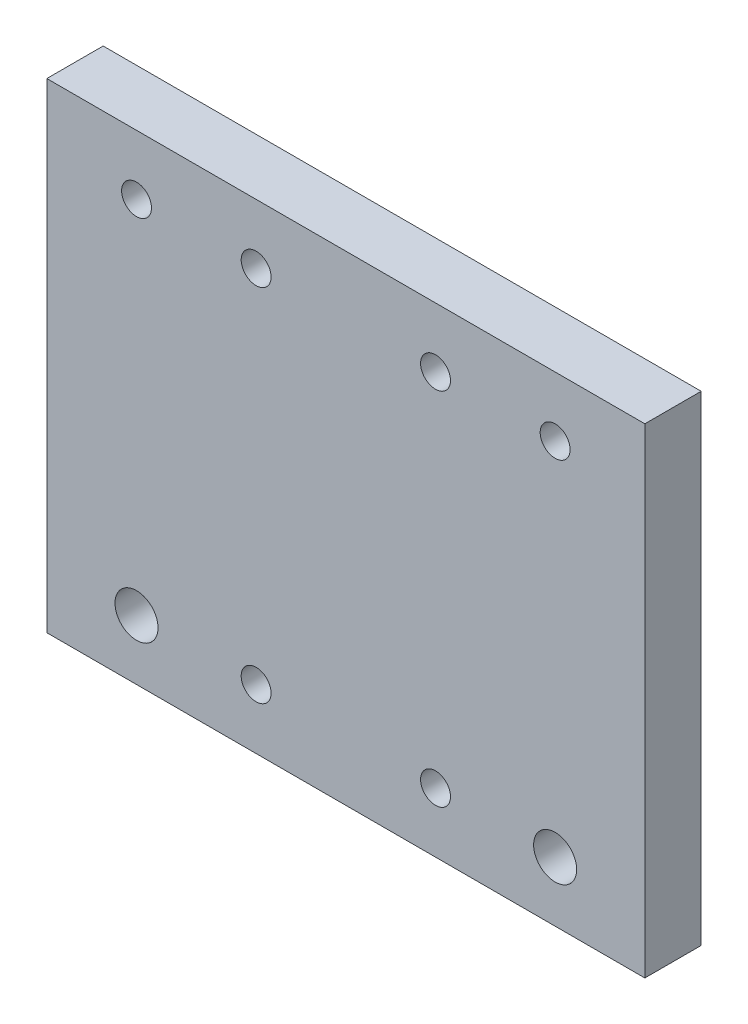
ISO-10303-21;
HEADER;
FILE_DESCRIPTION(('STEP AP214'),'2;1');
FILE_NAME('part.step','',(''),(''),'','','');
FILE_SCHEMA(('AUTOMOTIVE_DESIGN { 1 0 10303 214 1 1 1 1 }'));
ENDSEC;
DATA;
#1=APPLICATION_CONTEXT('core data for automotive mechanical design processes');
#2=APPLICATION_PROTOCOL_DEFINITION('international standard','automotive_design',2000,#1);
#3=PRODUCT_CONTEXT('',#1,'mechanical');
#4=PRODUCT('Part','Part','',(#3));
#5=PRODUCT_RELATED_PRODUCT_CATEGORY('part','',(#4));
#6=PRODUCT_DEFINITION_FORMATION('','',#4);
#7=PRODUCT_DEFINITION_CONTEXT('part definition',#1,'design');
#8=PRODUCT_DEFINITION('design','',#6,#7);
#9=PRODUCT_DEFINITION_SHAPE('','',#8);
#10=(LENGTH_UNIT() NAMED_UNIT(*) SI_UNIT(.MILLI.,.METRE.));
#11=(NAMED_UNIT(*) PLANE_ANGLE_UNIT() SI_UNIT($,.RADIAN.));
#12=(NAMED_UNIT(*) SI_UNIT($,.STERADIAN.) SOLID_ANGLE_UNIT());
#13=UNCERTAINTY_MEASURE_WITH_UNIT(LENGTH_MEASURE(1.E-05),#10,'distance_accuracy_value','');
#14=(GEOMETRIC_REPRESENTATION_CONTEXT(3) GLOBAL_UNCERTAINTY_ASSIGNED_CONTEXT((#13)) GLOBAL_UNIT_ASSIGNED_CONTEXT((#10,
#11,#12)) REPRESENTATION_CONTEXT('',''));
#15=CARTESIAN_POINT('',(0.,0.,0.));
#16=DIRECTION('',(0.,0.,1.));
#17=DIRECTION('',(1.,0.,0.));
#18=AXIS2_PLACEMENT_3D('',#15,#16,#17);
#19=CARTESIAN_POINT('',(0.,0.,9.42));
#20=DIRECTION('',(0.,0.,-1.));
#21=DIRECTION('',(-1.,0.,0.));
#22=AXIS2_PLACEMENT_3D('',#19,#20,#21);
#23=PLANE('',#22);
#24=CARTESIAN_POINT('',(37.710746881296,44.9525516862519,9.42));
#25=DIRECTION('',(0.,0.,1.));
#26=DIRECTION('',(1.,0.,0.));
#27=AXIS2_PLACEMENT_3D('',#24,#25,#26);
#28=CIRCLE('',#27,2.5);
#29=CARTESIAN_POINT('',(40.210746881296,44.9525516862519,9.42));
#30=VERTEX_POINT('',#29);
#31=EDGE_CURVE('E155',#30,#30,#28,.T.);
#32=ORIENTED_EDGE('',*,*,#31,.F.);
#33=EDGE_LOOP('',(#32));
#34=FACE_BOUND('',#33,.T.);
#35=CARTESIAN_POINT('',(67.710746881296,44.9525516862519,9.42));
#36=DIRECTION('',(0.,0.,1.));
#37=DIRECTION('',(1.,0.,0.));
#38=AXIS2_PLACEMENT_3D('',#35,#36,#37);
#39=CIRCLE('',#38,2.5);
#40=CARTESIAN_POINT('',(70.210746881296,44.9525516862519,9.42));
#41=VERTEX_POINT('',#40);
#42=EDGE_CURVE('E161',#41,#41,#39,.T.);
#43=ORIENTED_EDGE('',*,*,#42,.F.);
#44=EDGE_LOOP('',(#43));
#45=FACE_BOUND('',#44,.T.);
#46=CARTESIAN_POINT('',(67.710746881296,-15.3074483137481,9.42));
#47=DIRECTION('',(0.,0.,1.));
#48=DIRECTION('',(1.,0.,0.));
#49=AXIS2_PLACEMENT_3D('',#46,#47,#48);
#50=CIRCLE('',#49,2.49999999999999);
#51=CARTESIAN_POINT('',(70.210746881296,-15.3074483137481,9.42));
#52=VERTEX_POINT('',#51);
#53=EDGE_CURVE('E167',#52,#52,#50,.T.);
#54=ORIENTED_EDGE('',*,*,#53,.F.);
#55=EDGE_LOOP('',(#54));
#56=FACE_BOUND('',#55,.T.);
#57=CARTESIAN_POINT('',(37.710746881296,-15.3074483137481,9.42));
#58=DIRECTION('',(0.,0.,1.));
#59=DIRECTION('',(1.,0.,0.));
#60=AXIS2_PLACEMENT_3D('',#57,#58,#59);
#61=CIRCLE('',#60,2.5);
#62=CARTESIAN_POINT('',(40.210746881296,-15.3074483137481,9.42));
#63=VERTEX_POINT('',#62);
#64=EDGE_CURVE('E149',#63,#63,#61,.T.);
#65=ORIENTED_EDGE('',*,*,#64,.F.);
#66=EDGE_LOOP('',(#65));
#67=FACE_BOUND('',#66,.T.);
#68=DIRECTION('',(0.,-1.,0.));
#69=VECTOR('',#68,1.);
#70=CARTESIAN_POINT('',(2.71074688129598,-25.3074483137481,9.42));
#71=LINE('',#70,#69);
#72=CARTESIAN_POINT('',(2.71074688129598,54.9525516862519,9.42));
#73=VERTEX_POINT('',#72);
#74=CARTESIAN_POINT('',(2.71074688129598,-25.3074483137481,9.42));
#75=VERTEX_POINT('',#74);
#76=EDGE_CURVE('E98',#73,#75,#71,.T.);
#77=ORIENTED_EDGE('',*,*,#76,.T.);
#78=DIRECTION('',(1.,0.,0.));
#79=VECTOR('',#78,1.);
#80=CARTESIAN_POINT('',(2.71074688129598,-25.3074483137481,9.42));
#81=LINE('',#80,#79);
#82=CARTESIAN_POINT('',(102.710746881296,-25.3074483137481,9.42));
#83=VERTEX_POINT('',#82);
#84=EDGE_CURVE('E93',#75,#83,#81,.T.);
#85=ORIENTED_EDGE('',*,*,#84,.T.);
#86=DIRECTION('',(0.,1.,0.));
#87=VECTOR('',#86,1.);
#88=CARTESIAN_POINT('',(102.710746881296,-25.3074483137481,9.42));
#89=LINE('',#88,#87);
#90=CARTESIAN_POINT('',(102.710746881296,54.9525516862519,9.42));
#91=VERTEX_POINT('',#90);
#92=EDGE_CURVE('E96',#83,#91,#89,.T.);
#93=ORIENTED_EDGE('',*,*,#92,.T.);
#94=DIRECTION('',(-1.,0.,0.));
#95=VECTOR('',#94,1.);
#96=CARTESIAN_POINT('',(2.71074688129598,54.9525516862519,9.42));
#97=LINE('',#96,#95);
#98=EDGE_CURVE('E63',#91,#73,#97,.T.);
#99=ORIENTED_EDGE('',*,*,#98,.T.);
#100=EDGE_LOOP('',(#77,#85,#93,#99));
#101=FACE_BOUND('',#100,.T.);
#102=CARTESIAN_POINT('',(17.710746881296,-15.3074483137481,9.42));
#103=DIRECTION('',(0.,0.,1.));
#104=DIRECTION('',(1.,0.,0.));
#105=AXIS2_PLACEMENT_3D('',#102,#103,#104);
#106=CIRCLE('',#105,3.6);
#107=CARTESIAN_POINT('',(21.310746881296,-15.3074483137481,9.42));
#108=VERTEX_POINT('',#107);
#109=EDGE_CURVE('E113',#108,#108,#106,.T.);
#110=ORIENTED_EDGE('',*,*,#109,.F.);
#111=EDGE_LOOP('',(#110));
#112=FACE_BOUND('',#111,.T.);
#113=CARTESIAN_POINT('',(87.710746881296,44.9525516862519,9.42));
#114=DIRECTION('',(0.,0.,1.));
#115=DIRECTION('',(1.,0.,0.));
#116=AXIS2_PLACEMENT_3D('',#113,#114,#115);
#117=CIRCLE('',#116,2.5);
#118=CARTESIAN_POINT('',(90.210746881296,44.9525516862519,9.42));
#119=VERTEX_POINT('',#118);
#120=EDGE_CURVE('E128',#119,#119,#117,.T.);
#121=ORIENTED_EDGE('',*,*,#120,.F.);
#122=EDGE_LOOP('',(#121));
#123=FACE_BOUND('',#122,.T.);
#124=CARTESIAN_POINT('',(17.710746881296,44.9525516862519,9.42));
#125=DIRECTION('',(0.,0.,1.));
#126=DIRECTION('',(1.,0.,0.));
#127=AXIS2_PLACEMENT_3D('',#124,#125,#126);
#128=CIRCLE('',#127,2.5);
#129=CARTESIAN_POINT('',(20.210746881296,44.9525516862519,9.42));
#130=VERTEX_POINT('',#129);
#131=EDGE_CURVE('E134',#130,#130,#128,.T.);
#132=ORIENTED_EDGE('',*,*,#131,.F.);
#133=EDGE_LOOP('',(#132));
#134=FACE_BOUND('',#133,.T.);
#135=CARTESIAN_POINT('',(87.710746881296,-15.3074483137481,9.42));
#136=DIRECTION('',(0.,0.,1.));
#137=DIRECTION('',(1.,0.,0.));
#138=AXIS2_PLACEMENT_3D('',#135,#136,#137);
#139=CIRCLE('',#138,3.6);
#140=CARTESIAN_POINT('',(91.310746881296,-15.3074483137481,9.42));
#141=VERTEX_POINT('',#140);
#142=EDGE_CURVE('E140',#141,#141,#139,.T.);
#143=ORIENTED_EDGE('',*,*,#142,.F.);
#144=EDGE_LOOP('',(#143));
#145=FACE_BOUND('',#144,.T.);
#146=ADVANCED_FACE('F46',(#34,#45,#56,#67,#101,#112,#123,#134,#145),#23,.F.);
#147=CARTESIAN_POINT('',(0.,0.,0.));
#148=DIRECTION('',(0.,0.,-1.));
#149=DIRECTION('',(-1.,0.,0.));
#150=AXIS2_PLACEMENT_3D('',#147,#148,#149);
#151=PLANE('',#150);
#152=CARTESIAN_POINT('',(37.710746881296,44.9525516862519,0.));
#153=DIRECTION('',(0.,0.,1.));
#154=DIRECTION('',(1.,0.,0.));
#155=AXIS2_PLACEMENT_3D('',#152,#153,#154);
#156=CIRCLE('',#155,2.5);
#157=CARTESIAN_POINT('',(40.210746881296,44.9525516862519,0.));
#158=VERTEX_POINT('',#157);
#159=EDGE_CURVE('E158',#158,#158,#156,.T.);
#160=ORIENTED_EDGE('',*,*,#159,.T.);
#161=EDGE_LOOP('',(#160));
#162=FACE_BOUND('',#161,.T.);
#163=CARTESIAN_POINT('',(67.710746881296,44.9525516862519,0.));
#164=DIRECTION('',(0.,0.,1.));
#165=DIRECTION('',(1.,0.,0.));
#166=AXIS2_PLACEMENT_3D('',#163,#164,#165);
#167=CIRCLE('',#166,2.5);
#168=CARTESIAN_POINT('',(70.210746881296,44.9525516862519,0.));
#169=VERTEX_POINT('',#168);
#170=EDGE_CURVE('E164',#169,#169,#167,.T.);
#171=ORIENTED_EDGE('',*,*,#170,.T.);
#172=EDGE_LOOP('',(#171));
#173=FACE_BOUND('',#172,.T.);
#174=CARTESIAN_POINT('',(67.710746881296,-15.3074483137481,0.));
#175=DIRECTION('',(0.,0.,1.));
#176=DIRECTION('',(1.,0.,0.));
#177=AXIS2_PLACEMENT_3D('',#174,#175,#176);
#178=CIRCLE('',#177,2.49999999999999);
#179=CARTESIAN_POINT('',(70.210746881296,-15.3074483137481,0.));
#180=VERTEX_POINT('',#179);
#181=EDGE_CURVE('E152',#180,#180,#178,.T.);
#182=ORIENTED_EDGE('',*,*,#181,.T.);
#183=EDGE_LOOP('',(#182));
#184=FACE_BOUND('',#183,.T.);
#185=CARTESIAN_POINT('',(37.710746881296,-15.3074483137481,0.));
#186=DIRECTION('',(0.,0.,1.));
#187=DIRECTION('',(1.,0.,0.));
#188=AXIS2_PLACEMENT_3D('',#185,#186,#187);
#189=CIRCLE('',#188,2.5);
#190=CARTESIAN_POINT('',(40.210746881296,-15.3074483137481,0.));
#191=VERTEX_POINT('',#190);
#192=EDGE_CURVE('E146',#191,#191,#189,.T.);
#193=ORIENTED_EDGE('',*,*,#192,.T.);
#194=EDGE_LOOP('',(#193));
#195=FACE_BOUND('',#194,.T.);
#196=CARTESIAN_POINT('',(17.710746881296,44.9525516862519,0.));
#197=DIRECTION('',(0.,0.,1.));
#198=DIRECTION('',(1.,0.,0.));
#199=AXIS2_PLACEMENT_3D('',#196,#197,#198);
#200=CIRCLE('',#199,2.5);
#201=CARTESIAN_POINT('',(20.210746881296,44.9525516862519,0.));
#202=VERTEX_POINT('',#201);
#203=EDGE_CURVE('E137',#202,#202,#200,.T.);
#204=ORIENTED_EDGE('',*,*,#203,.T.);
#205=EDGE_LOOP('',(#204));
#206=FACE_BOUND('',#205,.T.);
#207=CARTESIAN_POINT('',(17.710746881296,-15.3074483137481,0.));
#208=DIRECTION('',(0.,0.,1.));
#209=DIRECTION('',(1.,0.,0.));
#210=AXIS2_PLACEMENT_3D('',#207,#208,#209);
#211=CIRCLE('',#210,3.6);
#212=CARTESIAN_POINT('',(21.310746881296,-15.3074483137481,0.));
#213=VERTEX_POINT('',#212);
#214=EDGE_CURVE('E125',#213,#213,#211,.T.);
#215=ORIENTED_EDGE('',*,*,#214,.T.);
#216=EDGE_LOOP('',(#215));
#217=FACE_BOUND('',#216,.T.);
#218=DIRECTION('',(0.,-1.,0.));
#219=VECTOR('',#218,1.);
#220=CARTESIAN_POINT('',(2.71074688129598,-25.3074483137481,0.));
#221=LINE('',#220,#219);
#222=CARTESIAN_POINT('',(2.71074688129598,54.9525516862519,0.));
#223=VERTEX_POINT('',#222);
#224=CARTESIAN_POINT('',(2.71074688129598,-25.3074483137481,0.));
#225=VERTEX_POINT('',#224);
#226=EDGE_CURVE('E110',#223,#225,#221,.T.);
#227=ORIENTED_EDGE('',*,*,#226,.F.);
#228=DIRECTION('',(-1.,0.,0.));
#229=VECTOR('',#228,1.);
#230=CARTESIAN_POINT('',(2.71074688129598,54.9525516862519,0.));
#231=LINE('',#230,#229);
#232=CARTESIAN_POINT('',(102.710746881296,54.9525516862519,0.));
#233=VERTEX_POINT('',#232);
#234=EDGE_CURVE('E86',#233,#223,#231,.T.);
#235=ORIENTED_EDGE('',*,*,#234,.F.);
#236=DIRECTION('',(0.,1.,0.));
#237=VECTOR('',#236,1.);
#238=CARTESIAN_POINT('',(102.710746881296,-25.3074483137481,0.));
#239=LINE('',#238,#237);
#240=CARTESIAN_POINT('',(102.710746881296,-25.3074483137481,0.));
#241=VERTEX_POINT('',#240);
#242=EDGE_CURVE('E80',#241,#233,#239,.T.);
#243=ORIENTED_EDGE('',*,*,#242,.F.);
#244=DIRECTION('',(1.,0.,0.));
#245=VECTOR('',#244,1.);
#246=CARTESIAN_POINT('',(2.71074688129598,-25.3074483137481,0.));
#247=LINE('',#246,#245);
#248=EDGE_CURVE('E102',#225,#241,#247,.T.);
#249=ORIENTED_EDGE('',*,*,#248,.F.);
#250=EDGE_LOOP('',(#227,#235,#243,#249));
#251=FACE_BOUND('',#250,.T.);
#252=CARTESIAN_POINT('',(87.710746881296,44.9525516862519,0.));
#253=DIRECTION('',(0.,0.,1.));
#254=DIRECTION('',(1.,0.,0.));
#255=AXIS2_PLACEMENT_3D('',#252,#253,#254);
#256=CIRCLE('',#255,2.5);
#257=CARTESIAN_POINT('',(90.210746881296,44.9525516862519,0.));
#258=VERTEX_POINT('',#257);
#259=EDGE_CURVE('E131',#258,#258,#256,.T.);
#260=ORIENTED_EDGE('',*,*,#259,.T.);
#261=EDGE_LOOP('',(#260));
#262=FACE_BOUND('',#261,.T.);
#263=CARTESIAN_POINT('',(87.710746881296,-15.3074483137481,0.));
#264=DIRECTION('',(0.,0.,1.));
#265=DIRECTION('',(1.,0.,0.));
#266=AXIS2_PLACEMENT_3D('',#263,#264,#265);
#267=CIRCLE('',#266,3.6);
#268=CARTESIAN_POINT('',(91.310746881296,-15.3074483137481,0.));
#269=VERTEX_POINT('',#268);
#270=EDGE_CURVE('E143',#269,#269,#267,.T.);
#271=ORIENTED_EDGE('',*,*,#270,.T.);
#272=EDGE_LOOP('',(#271));
#273=FACE_BOUND('',#272,.T.);
#274=ADVANCED_FACE('F121',(#162,#173,#184,#195,#206,#217,#251,#262,#273),#151,.T.);
#275=CARTESIAN_POINT('',(2.71074688129598,-25.3074483137481,9.42));
#276=DIRECTION('',(1.,0.,0.));
#277=DIRECTION('',(0.,0.,-1.));
#278=AXIS2_PLACEMENT_3D('',#275,#276,#277);
#279=PLANE('',#278);
#280=ORIENTED_EDGE('',*,*,#226,.T.);
#281=DIRECTION('',(0.,0.,-1.));
#282=VECTOR('',#281,1.);
#283=CARTESIAN_POINT('',(2.71074688129598,-25.3074483137481,9.42));
#284=LINE('',#283,#282);
#285=EDGE_CURVE('E13',#75,#225,#284,.T.);
#286=ORIENTED_EDGE('',*,*,#285,.F.);
#287=ORIENTED_EDGE('',*,*,#76,.F.);
#288=DIRECTION('',(0.,0.,-1.));
#289=VECTOR('',#288,1.);
#290=CARTESIAN_POINT('',(2.71074688129598,54.9525516862519,9.42));
#291=LINE('',#290,#289);
#292=EDGE_CURVE('E106',#73,#223,#291,.T.);
#293=ORIENTED_EDGE('',*,*,#292,.T.);
#294=EDGE_LOOP('',(#280,#286,#287,#293));
#295=FACE_BOUND('',#294,.T.);
#296=ADVANCED_FACE('F48',(#295),#279,.F.);
#297=CARTESIAN_POINT('',(2.71074688129598,-25.3074483137481,9.42));
#298=DIRECTION('',(0.,1.,0.));
#299=DIRECTION('',(0.,0.,1.));
#300=AXIS2_PLACEMENT_3D('',#297,#298,#299);
#301=PLANE('',#300);
#302=ORIENTED_EDGE('',*,*,#248,.T.);
#303=DIRECTION('',(0.,0.,-1.));
#304=VECTOR('',#303,1.);
#305=CARTESIAN_POINT('',(102.710746881296,-25.3074483137481,9.42));
#306=LINE('',#305,#304);
#307=EDGE_CURVE('E55',#83,#241,#306,.T.);
#308=ORIENTED_EDGE('',*,*,#307,.F.);
#309=ORIENTED_EDGE('',*,*,#84,.F.);
#310=ORIENTED_EDGE('',*,*,#285,.T.);
#311=EDGE_LOOP('',(#302,#308,#309,#310));
#312=FACE_BOUND('',#311,.T.);
#313=ADVANCED_FACE('F101',(#312),#301,.F.);
#314=CARTESIAN_POINT('',(102.710746881296,-25.3074483137481,9.42));
#315=DIRECTION('',(-1.,0.,0.));
#316=DIRECTION('',(0.,0.,1.));
#317=AXIS2_PLACEMENT_3D('',#314,#315,#316);
#318=PLANE('',#317);
#319=ORIENTED_EDGE('',*,*,#242,.T.);
#320=DIRECTION('',(0.,0.,-1.));
#321=VECTOR('',#320,1.);
#322=CARTESIAN_POINT('',(102.710746881296,54.9525516862519,9.42));
#323=LINE('',#322,#321);
#324=EDGE_CURVE('E103',#91,#233,#323,.T.);
#325=ORIENTED_EDGE('',*,*,#324,.F.);
#326=ORIENTED_EDGE('',*,*,#92,.F.);
#327=ORIENTED_EDGE('',*,*,#307,.T.);
#328=EDGE_LOOP('',(#319,#325,#326,#327));
#329=FACE_BOUND('',#328,.T.);
#330=ADVANCED_FACE('F104',(#329),#318,.F.);
#331=CARTESIAN_POINT('',(2.71074688129598,54.9525516862519,9.42));
#332=DIRECTION('',(0.,-1.,0.));
#333=DIRECTION('',(0.,0.,-1.));
#334=AXIS2_PLACEMENT_3D('',#331,#332,#333);
#335=PLANE('',#334);
#336=ORIENTED_EDGE('',*,*,#234,.T.);
#337=ORIENTED_EDGE('',*,*,#292,.F.);
#338=ORIENTED_EDGE('',*,*,#98,.F.);
#339=ORIENTED_EDGE('',*,*,#324,.T.);
#340=EDGE_LOOP('',(#336,#337,#338,#339));
#341=FACE_BOUND('',#340,.T.);
#342=ADVANCED_FACE('F118',(#341),#335,.F.);
#343=CARTESIAN_POINT('',(17.710746881296,-15.3074483137481,9.42));
#344=DIRECTION('',(0.,0.,-1.));
#345=DIRECTION('',(-1.,0.,0.));
#346=AXIS2_PLACEMENT_3D('',#343,#344,#345);
#347=CYLINDRICAL_SURFACE('',#346,3.6);
#348=ORIENTED_EDGE('',*,*,#109,.T.);
#349=EDGE_LOOP('',(#348));
#350=FACE_BOUND('',#349,.T.);
#351=ORIENTED_EDGE('',*,*,#214,.F.);
#352=EDGE_LOOP('',(#351));
#353=FACE_BOUND('',#352,.T.);
#354=ADVANCED_FACE('F210',(#350,#353),#347,.F.);
#355=CARTESIAN_POINT('',(87.710746881296,44.9525516862519,9.42));
#356=DIRECTION('',(0.,0.,-1.));
#357=DIRECTION('',(-1.,0.,0.));
#358=AXIS2_PLACEMENT_3D('',#355,#356,#357);
#359=CYLINDRICAL_SURFACE('',#358,2.5);
#360=ORIENTED_EDGE('',*,*,#120,.T.);
#361=EDGE_LOOP('',(#360));
#362=FACE_BOUND('',#361,.T.);
#363=ORIENTED_EDGE('',*,*,#259,.F.);
#364=EDGE_LOOP('',(#363));
#365=FACE_BOUND('',#364,.T.);
#366=ADVANCED_FACE('F206',(#362,#365),#359,.F.);
#367=CARTESIAN_POINT('',(17.710746881296,44.9525516862519,9.42));
#368=DIRECTION('',(0.,0.,-1.));
#369=DIRECTION('',(-1.,0.,0.));
#370=AXIS2_PLACEMENT_3D('',#367,#368,#369);
#371=CYLINDRICAL_SURFACE('',#370,2.5);
#372=ORIENTED_EDGE('',*,*,#131,.T.);
#373=EDGE_LOOP('',(#372));
#374=FACE_BOUND('',#373,.T.);
#375=ORIENTED_EDGE('',*,*,#203,.F.);
#376=EDGE_LOOP('',(#375));
#377=FACE_BOUND('',#376,.T.);
#378=ADVANCED_FACE('F196',(#374,#377),#371,.F.);
#379=CARTESIAN_POINT('',(87.710746881296,-15.3074483137481,9.42));
#380=DIRECTION('',(0.,0.,-1.));
#381=DIRECTION('',(-1.,0.,0.));
#382=AXIS2_PLACEMENT_3D('',#379,#380,#381);
#383=CYLINDRICAL_SURFACE('',#382,3.6);
#384=ORIENTED_EDGE('',*,*,#142,.T.);
#385=EDGE_LOOP('',(#384));
#386=FACE_BOUND('',#385,.T.);
#387=ORIENTED_EDGE('',*,*,#270,.F.);
#388=EDGE_LOOP('',(#387));
#389=FACE_BOUND('',#388,.T.);
#390=ADVANCED_FACE('F190',(#386,#389),#383,.F.);
#391=CARTESIAN_POINT('',(37.710746881296,-15.3074483137481,0.));
#392=DIRECTION('',(0.,0.,1.));
#393=DIRECTION('',(1.,0.,0.));
#394=AXIS2_PLACEMENT_3D('',#391,#392,#393);
#395=CYLINDRICAL_SURFACE('',#394,2.5);
#396=ORIENTED_EDGE('',*,*,#192,.F.);
#397=EDGE_LOOP('',(#396));
#398=FACE_BOUND('',#397,.T.);
#399=ORIENTED_EDGE('',*,*,#64,.T.);
#400=EDGE_LOOP('',(#399));
#401=FACE_BOUND('',#400,.T.);
#402=ADVANCED_FACE('F179',(#398,#401),#395,.F.);
#403=CARTESIAN_POINT('',(67.710746881296,-15.3074483137481,0.));
#404=DIRECTION('',(0.,0.,1.));
#405=DIRECTION('',(1.,0.,0.));
#406=AXIS2_PLACEMENT_3D('',#403,#404,#405);
#407=CYLINDRICAL_SURFACE('',#406,2.49999999999999);
#408=ORIENTED_EDGE('',*,*,#181,.F.);
#409=EDGE_LOOP('',(#408));
#410=FACE_BOUND('',#409,.T.);
#411=ORIENTED_EDGE('',*,*,#53,.T.);
#412=EDGE_LOOP('',(#411));
#413=FACE_BOUND('',#412,.T.);
#414=ADVANCED_FACE('F175',(#410,#413),#407,.F.);
#415=CARTESIAN_POINT('',(67.710746881296,44.9525516862519,0.));
#416=DIRECTION('',(0.,0.,1.));
#417=DIRECTION('',(1.,0.,0.));
#418=AXIS2_PLACEMENT_3D('',#415,#416,#417);
#419=CYLINDRICAL_SURFACE('',#418,2.5);
#420=ORIENTED_EDGE('',*,*,#170,.F.);
#421=EDGE_LOOP('',(#420));
#422=FACE_BOUND('',#421,.T.);
#423=ORIENTED_EDGE('',*,*,#42,.T.);
#424=EDGE_LOOP('',(#423));
#425=FACE_BOUND('',#424,.T.);
#426=ADVANCED_FACE('F178',(#422,#425),#419,.F.);
#427=CARTESIAN_POINT('',(37.710746881296,44.9525516862519,0.));
#428=DIRECTION('',(0.,0.,1.));
#429=DIRECTION('',(1.,0.,0.));
#430=AXIS2_PLACEMENT_3D('',#427,#428,#429);
#431=CYLINDRICAL_SURFACE('',#430,2.5);
#432=ORIENTED_EDGE('',*,*,#159,.F.);
#433=EDGE_LOOP('',(#432));
#434=FACE_BOUND('',#433,.T.);
#435=ORIENTED_EDGE('',*,*,#31,.T.);
#436=EDGE_LOOP('',(#435));
#437=FACE_BOUND('',#436,.T.);
#438=ADVANCED_FACE('F201',(#434,#437),#431,.F.);
#439=CLOSED_SHELL('',(#146,#274,#296,#313,#330,#342,#354,#366,#378,#390,#402,#414,#426,#438));
#440=MANIFOLD_SOLID_BREP('B2',#439);
#441=ADVANCED_BREP_SHAPE_REPRESENTATION('',(#18,#440),#14);
#442=SHAPE_DEFINITION_REPRESENTATION(#9,#441);
ENDSEC;
END-ISO-10303-21;
